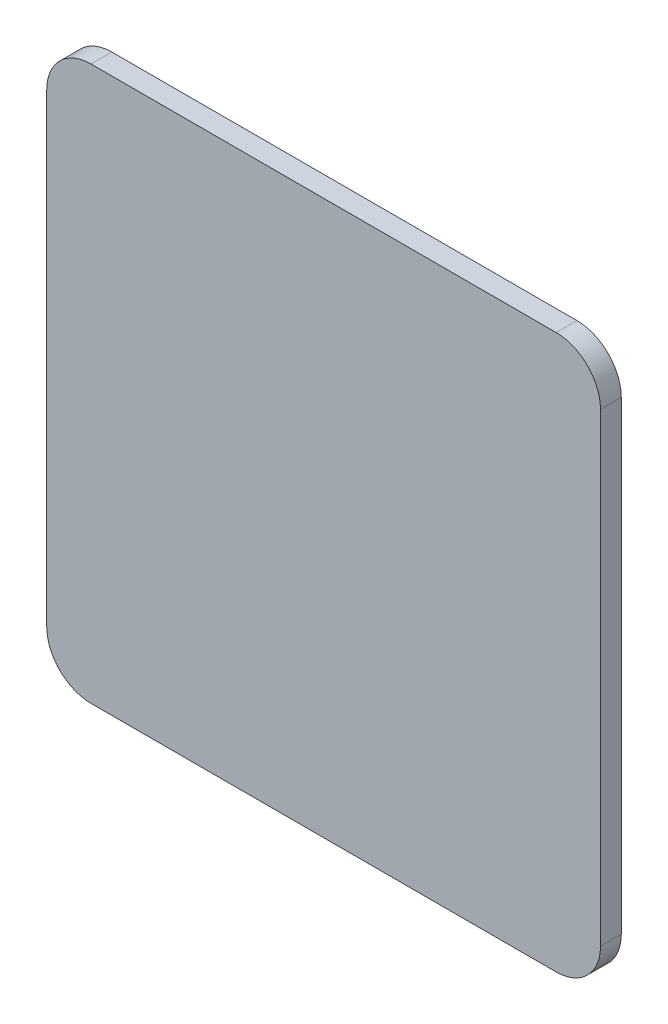
ISO-10303-21;
HEADER;
FILE_DESCRIPTION(('STEP AP214'),'2;1');
FILE_NAME('part.step','',(''),(''),'','','');
FILE_SCHEMA(('AUTOMOTIVE_DESIGN { 1 0 10303 214 1 1 1 1 }'));
ENDSEC;
DATA;
#1=APPLICATION_CONTEXT('core data for automotive mechanical design processes');
#2=APPLICATION_PROTOCOL_DEFINITION('international standard','automotive_design',2000,#1);
#3=PRODUCT_CONTEXT('',#1,'mechanical');
#4=PRODUCT('Part','Part','',(#3));
#5=PRODUCT_RELATED_PRODUCT_CATEGORY('part','',(#4));
#6=PRODUCT_DEFINITION_FORMATION('','',#4);
#7=PRODUCT_DEFINITION_CONTEXT('part definition',#1,'design');
#8=PRODUCT_DEFINITION('design','',#6,#7);
#9=PRODUCT_DEFINITION_SHAPE('','',#8);
#10=(LENGTH_UNIT() NAMED_UNIT(*) SI_UNIT(.MILLI.,.METRE.));
#11=(NAMED_UNIT(*) PLANE_ANGLE_UNIT() SI_UNIT($,.RADIAN.));
#12=(NAMED_UNIT(*) SI_UNIT($,.STERADIAN.) SOLID_ANGLE_UNIT());
#13=UNCERTAINTY_MEASURE_WITH_UNIT(LENGTH_MEASURE(1.E-05),#10,'distance_accuracy_value','');
#14=(GEOMETRIC_REPRESENTATION_CONTEXT(3) GLOBAL_UNCERTAINTY_ASSIGNED_CONTEXT((#13)) GLOBAL_UNIT_ASSIGNED_CONTEXT((#10,
#11,#12)) REPRESENTATION_CONTEXT('',''));
#15=CARTESIAN_POINT('',(0.,0.,0.));
#16=DIRECTION('',(0.,0.,1.));
#17=DIRECTION('',(1.,0.,0.));
#18=AXIS2_PLACEMENT_3D('',#15,#16,#17);
#19=CARTESIAN_POINT('',(0.,63.5,4.7625));
#20=DIRECTION('',(0.,-1.,0.));
#21=DIRECTION('',(1.,0.,0.));
#22=AXIS2_PLACEMENT_3D('',#19,#20,#21);
#23=PLANE('',#22);
#24=DIRECTION('',(-1.,0.,0.));
#25=VECTOR('',#24,1.);
#26=CARTESIAN_POINT('',(0.,63.5,0.));
#27=LINE('',#26,#25);
#28=CARTESIAN_POINT('',(53.3399999999999,63.5,0.));
#29=VERTEX_POINT('',#28);
#30=CARTESIAN_POINT('',(-53.3399999999999,63.5,0.));
#31=VERTEX_POINT('',#30);
#32=EDGE_CURVE('E131',#29,#31,#27,.T.);
#33=ORIENTED_EDGE('',*,*,#32,.T.);
#34=DIRECTION('',(0.,0.,-1.));
#35=VECTOR('',#34,1.);
#36=CARTESIAN_POINT('',(-53.3399999999999,63.5,4.7625));
#37=LINE('',#36,#35);
#38=CARTESIAN_POINT('',(-53.3399999999999,63.5,4.7625));
#39=VERTEX_POINT('',#38);
#40=EDGE_CURVE('E11',#39,#31,#37,.T.);
#41=ORIENTED_EDGE('',*,*,#40,.F.);
#42=DIRECTION('',(-1.,0.,0.));
#43=VECTOR('',#42,1.);
#44=CARTESIAN_POINT('',(0.,63.5,4.7625));
#45=LINE('',#44,#43);
#46=CARTESIAN_POINT('',(53.3399999999999,63.5,4.7625));
#47=VERTEX_POINT('',#46);
#48=EDGE_CURVE('E148',#47,#39,#45,.T.);
#49=ORIENTED_EDGE('',*,*,#48,.F.);
#50=DIRECTION('',(0.,0.,-1.));
#51=VECTOR('',#50,1.);
#52=CARTESIAN_POINT('',(53.3399999999999,63.5,4.7625));
#53=LINE('',#52,#51);
#54=EDGE_CURVE('E127',#47,#29,#53,.T.);
#55=ORIENTED_EDGE('',*,*,#54,.T.);
#56=EDGE_LOOP('',(#33,#41,#49,#55));
#57=FACE_BOUND('',#56,.T.);
#58=ADVANCED_FACE('F37',(#57),#23,.F.);
#59=CARTESIAN_POINT('',(-53.34,53.34,4.7625));
#60=DIRECTION('',(0.,0.,-1.));
#61=DIRECTION('',(-1.,0.,0.));
#62=AXIS2_PLACEMENT_3D('',#59,#60,#61);
#63=CYLINDRICAL_SURFACE('',#62,10.16);
#64=CARTESIAN_POINT('',(-53.34,53.34,0.));
#65=DIRECTION('',(0.,0.,1.));
#66=DIRECTION('',(1.,0.,0.));
#67=AXIS2_PLACEMENT_3D('',#64,#65,#66);
#68=CIRCLE('',#67,10.16);
#69=CARTESIAN_POINT('',(-63.5,53.3399999999999,0.));
#70=VERTEX_POINT('',#69);
#71=EDGE_CURVE('E134',#31,#70,#68,.T.);
#72=ORIENTED_EDGE('',*,*,#71,.T.);
#73=DIRECTION('',(0.,0.,-1.));
#74=VECTOR('',#73,1.);
#75=CARTESIAN_POINT('',(-63.5,53.3399999999999,4.7625));
#76=LINE('',#75,#74);
#77=CARTESIAN_POINT('',(-63.5,53.3399999999999,4.7625));
#78=VERTEX_POINT('',#77);
#79=EDGE_CURVE('E45',#78,#70,#76,.T.);
#80=ORIENTED_EDGE('',*,*,#79,.F.);
#81=CARTESIAN_POINT('',(-53.34,53.34,4.7625));
#82=DIRECTION('',(0.,0.,1.));
#83=DIRECTION('',(1.,0.,0.));
#84=AXIS2_PLACEMENT_3D('',#81,#82,#83);
#85=CIRCLE('',#84,10.16);
#86=EDGE_CURVE('E92',#39,#78,#85,.T.);
#87=ORIENTED_EDGE('',*,*,#86,.F.);
#88=ORIENTED_EDGE('',*,*,#40,.T.);
#89=EDGE_LOOP('',(#72,#80,#87,#88));
#90=FACE_BOUND('',#89,.T.);
#91=ADVANCED_FACE('F180',(#90),#63,.T.);
#92=CARTESIAN_POINT('',(-63.5,0.,4.7625));
#93=DIRECTION('',(1.,0.,0.));
#94=DIRECTION('',(0.,1.,0.));
#95=AXIS2_PLACEMENT_3D('',#92,#93,#94);
#96=PLANE('',#95);
#97=DIRECTION('',(0.,-1.,0.));
#98=VECTOR('',#97,1.);
#99=CARTESIAN_POINT('',(-63.5,0.,0.));
#100=LINE('',#99,#98);
#101=CARTESIAN_POINT('',(-63.5,-53.34,0.));
#102=VERTEX_POINT('',#101);
#103=EDGE_CURVE('E136',#70,#102,#100,.T.);
#104=ORIENTED_EDGE('',*,*,#103,.T.);
#105=DIRECTION('',(0.,0.,-1.));
#106=VECTOR('',#105,1.);
#107=CARTESIAN_POINT('',(-63.5,-53.34,4.7625));
#108=LINE('',#107,#106);
#109=CARTESIAN_POINT('',(-63.5,-53.34,4.7625));
#110=VERTEX_POINT('',#109);
#111=EDGE_CURVE('E154',#110,#102,#108,.T.);
#112=ORIENTED_EDGE('',*,*,#111,.F.);
#113=DIRECTION('',(0.,-1.,0.));
#114=VECTOR('',#113,1.);
#115=CARTESIAN_POINT('',(-63.5,0.,4.7625));
#116=LINE('',#115,#114);
#117=EDGE_CURVE('E162',#78,#110,#116,.T.);
#118=ORIENTED_EDGE('',*,*,#117,.F.);
#119=ORIENTED_EDGE('',*,*,#79,.T.);
#120=EDGE_LOOP('',(#104,#112,#118,#119));
#121=FACE_BOUND('',#120,.T.);
#122=ADVANCED_FACE('F160',(#121),#96,.F.);
#123=CARTESIAN_POINT('',(-53.34,-53.34,4.7625));
#124=DIRECTION('',(0.,0.,-1.));
#125=DIRECTION('',(-1.,0.,0.));
#126=AXIS2_PLACEMENT_3D('',#123,#124,#125);
#127=CYLINDRICAL_SURFACE('',#126,10.16);
#128=CARTESIAN_POINT('',(-53.34,-53.34,0.));
#129=DIRECTION('',(0.,0.,1.));
#130=DIRECTION('',(1.,0.,0.));
#131=AXIS2_PLACEMENT_3D('',#128,#129,#130);
#132=CIRCLE('',#131,10.16);
#133=CARTESIAN_POINT('',(-53.3399999999999,-63.5,0.));
#134=VERTEX_POINT('',#133);
#135=EDGE_CURVE('E138',#102,#134,#132,.T.);
#136=ORIENTED_EDGE('',*,*,#135,.T.);
#137=DIRECTION('',(0.,0.,-1.));
#138=VECTOR('',#137,1.);
#139=CARTESIAN_POINT('',(-53.3399999999999,-63.5,4.7625));
#140=LINE('',#139,#138);
#141=CARTESIAN_POINT('',(-53.3399999999999,-63.5,4.7625));
#142=VERTEX_POINT('',#141);
#143=EDGE_CURVE('E152',#142,#134,#140,.T.);
#144=ORIENTED_EDGE('',*,*,#143,.F.);
#145=CARTESIAN_POINT('',(-53.34,-53.34,4.7625));
#146=DIRECTION('',(0.,0.,1.));
#147=DIRECTION('',(1.,0.,0.));
#148=AXIS2_PLACEMENT_3D('',#145,#146,#147);
#149=CIRCLE('',#148,10.16);
#150=EDGE_CURVE('E172',#110,#142,#149,.T.);
#151=ORIENTED_EDGE('',*,*,#150,.F.);
#152=ORIENTED_EDGE('',*,*,#111,.T.);
#153=EDGE_LOOP('',(#136,#144,#151,#152));
#154=FACE_BOUND('',#153,.T.);
#155=ADVANCED_FACE('F170',(#154),#127,.T.);
#156=CARTESIAN_POINT('',(0.,-63.5,4.7625));
#157=DIRECTION('',(0.,-1.,0.));
#158=DIRECTION('',(1.,0.,0.));
#159=AXIS2_PLACEMENT_3D('',#156,#157,#158);
#160=PLANE('',#159);
#161=DIRECTION('',(-1.,0.,0.));
#162=VECTOR('',#161,1.);
#163=CARTESIAN_POINT('',(0.,-63.5,0.));
#164=LINE('',#163,#162);
#165=CARTESIAN_POINT('',(53.3399999999999,-63.5,0.));
#166=VERTEX_POINT('',#165);
#167=EDGE_CURVE('E141',#166,#134,#164,.T.);
#168=ORIENTED_EDGE('',*,*,#167,.F.);
#169=DIRECTION('',(0.,0.,-1.));
#170=VECTOR('',#169,1.);
#171=CARTESIAN_POINT('',(53.3399999999999,-63.5,4.7625));
#172=LINE('',#171,#170);
#173=CARTESIAN_POINT('',(53.3399999999999,-63.5,4.7625));
#174=VERTEX_POINT('',#173);
#175=EDGE_CURVE('E123',#174,#166,#172,.T.);
#176=ORIENTED_EDGE('',*,*,#175,.F.);
#177=DIRECTION('',(-1.,0.,0.));
#178=VECTOR('',#177,1.);
#179=CARTESIAN_POINT('',(0.,-63.5,4.7625));
#180=LINE('',#179,#178);
#181=EDGE_CURVE('E112',#174,#142,#180,.T.);
#182=ORIENTED_EDGE('',*,*,#181,.T.);
#183=ORIENTED_EDGE('',*,*,#143,.T.);
#184=EDGE_LOOP('',(#168,#176,#182,#183));
#185=FACE_BOUND('',#184,.T.);
#186=ADVANCED_FACE('F190',(#185),#160,.T.);
#187=CARTESIAN_POINT('',(53.34,-53.34,4.7625));
#188=DIRECTION('',(0.,0.,-1.));
#189=DIRECTION('',(-1.,0.,0.));
#190=AXIS2_PLACEMENT_3D('',#187,#188,#189);
#191=CYLINDRICAL_SURFACE('',#190,10.16);
#192=CARTESIAN_POINT('',(53.34,-53.34,0.));
#193=DIRECTION('',(0.,0.,1.));
#194=DIRECTION('',(1.,0.,0.));
#195=AXIS2_PLACEMENT_3D('',#192,#193,#194);
#196=CIRCLE('',#195,10.16);
#197=CARTESIAN_POINT('',(63.5,-53.3399999999999,0.));
#198=VERTEX_POINT('',#197);
#199=EDGE_CURVE('E119',#166,#198,#196,.T.);
#200=ORIENTED_EDGE('',*,*,#199,.T.);
#201=DIRECTION('',(0.,0.,-1.));
#202=VECTOR('',#201,1.);
#203=CARTESIAN_POINT('',(63.5,-53.3399999999999,4.7625));
#204=LINE('',#203,#202);
#205=CARTESIAN_POINT('',(63.5,-53.3399999999999,4.7625));
#206=VERTEX_POINT('',#205);
#207=EDGE_CURVE('E116',#206,#198,#204,.T.);
#208=ORIENTED_EDGE('',*,*,#207,.F.);
#209=CARTESIAN_POINT('',(53.34,-53.34,4.7625));
#210=DIRECTION('',(0.,0.,1.));
#211=DIRECTION('',(1.,0.,0.));
#212=AXIS2_PLACEMENT_3D('',#209,#210,#211);
#213=CIRCLE('',#212,10.16);
#214=EDGE_CURVE('E106',#174,#206,#213,.T.);
#215=ORIENTED_EDGE('',*,*,#214,.F.);
#216=ORIENTED_EDGE('',*,*,#175,.T.);
#217=EDGE_LOOP('',(#200,#208,#215,#216));
#218=FACE_BOUND('',#217,.T.);
#219=ADVANCED_FACE('F117',(#218),#191,.T.);
#220=CARTESIAN_POINT('',(63.5,0.,4.7625));
#221=DIRECTION('',(1.,0.,0.));
#222=DIRECTION('',(0.,1.,0.));
#223=AXIS2_PLACEMENT_3D('',#220,#221,#222);
#224=PLANE('',#223);
#225=DIRECTION('',(0.,-1.,0.));
#226=VECTOR('',#225,1.);
#227=CARTESIAN_POINT('',(63.5,0.,0.));
#228=LINE('',#227,#226);
#229=CARTESIAN_POINT('',(63.5,53.3399999999999,0.));
#230=VERTEX_POINT('',#229);
#231=EDGE_CURVE('E145',#230,#198,#228,.T.);
#232=ORIENTED_EDGE('',*,*,#231,.F.);
#233=DIRECTION('',(0.,0.,-1.));
#234=VECTOR('',#233,1.);
#235=CARTESIAN_POINT('',(63.5,53.3399999999999,4.7625));
#236=LINE('',#235,#234);
#237=CARTESIAN_POINT('',(63.5,53.3399999999999,4.7625));
#238=VERTEX_POINT('',#237);
#239=EDGE_CURVE('E81',#238,#230,#236,.T.);
#240=ORIENTED_EDGE('',*,*,#239,.F.);
#241=DIRECTION('',(0.,-1.,0.));
#242=VECTOR('',#241,1.);
#243=CARTESIAN_POINT('',(63.5,0.,4.7625));
#244=LINE('',#243,#242);
#245=EDGE_CURVE('E110',#238,#206,#244,.T.);
#246=ORIENTED_EDGE('',*,*,#245,.T.);
#247=ORIENTED_EDGE('',*,*,#207,.T.);
#248=EDGE_LOOP('',(#232,#240,#246,#247));
#249=FACE_BOUND('',#248,.T.);
#250=ADVANCED_FACE('F125',(#249),#224,.T.);
#251=CARTESIAN_POINT('',(53.34,53.34,4.7625));
#252=DIRECTION('',(0.,0.,-1.));
#253=DIRECTION('',(-1.,0.,0.));
#254=AXIS2_PLACEMENT_3D('',#251,#252,#253);
#255=CYLINDRICAL_SURFACE('',#254,10.16);
#256=CARTESIAN_POINT('',(53.34,53.34,0.));
#257=DIRECTION('',(0.,0.,1.));
#258=DIRECTION('',(1.,0.,0.));
#259=AXIS2_PLACEMENT_3D('',#256,#257,#258);
#260=CIRCLE('',#259,10.16);
#261=EDGE_CURVE('E84',#230,#29,#260,.T.);
#262=ORIENTED_EDGE('',*,*,#261,.T.);
#263=ORIENTED_EDGE('',*,*,#54,.F.);
#264=CARTESIAN_POINT('',(53.34,53.34,4.7625));
#265=DIRECTION('',(0.,0.,1.));
#266=DIRECTION('',(1.,0.,0.));
#267=AXIS2_PLACEMENT_3D('',#264,#265,#266);
#268=CIRCLE('',#267,10.16);
#269=EDGE_CURVE('E53',#238,#47,#268,.T.);
#270=ORIENTED_EDGE('',*,*,#269,.F.);
#271=ORIENTED_EDGE('',*,*,#239,.T.);
#272=EDGE_LOOP('',(#262,#263,#270,#271));
#273=FACE_BOUND('',#272,.T.);
#274=ADVANCED_FACE('F198',(#273),#255,.T.);
#275=CARTESIAN_POINT('',(0.,0.,4.7625));
#276=DIRECTION('',(0.,0.,1.));
#277=DIRECTION('',(1.,0.,0.));
#278=AXIS2_PLACEMENT_3D('',#275,#276,#277);
#279=PLANE('',#278);
#280=ORIENTED_EDGE('',*,*,#48,.T.);
#281=ORIENTED_EDGE('',*,*,#86,.T.);
#282=ORIENTED_EDGE('',*,*,#117,.T.);
#283=ORIENTED_EDGE('',*,*,#150,.T.);
#284=ORIENTED_EDGE('',*,*,#181,.F.);
#285=ORIENTED_EDGE('',*,*,#214,.T.);
#286=ORIENTED_EDGE('',*,*,#245,.F.);
#287=ORIENTED_EDGE('',*,*,#269,.T.);
#288=EDGE_LOOP('',(#280,#281,#282,#283,#284,#285,#286,#287));
#289=FACE_BOUND('',#288,.T.);
#290=ADVANCED_FACE('F108',(#289),#279,.T.);
#291=CARTESIAN_POINT('',(0.,0.,0.));
#292=DIRECTION('',(0.,0.,1.));
#293=DIRECTION('',(1.,0.,0.));
#294=AXIS2_PLACEMENT_3D('',#291,#292,#293);
#295=PLANE('',#294);
#296=ORIENTED_EDGE('',*,*,#32,.F.);
#297=ORIENTED_EDGE('',*,*,#261,.F.);
#298=ORIENTED_EDGE('',*,*,#231,.T.);
#299=ORIENTED_EDGE('',*,*,#199,.F.);
#300=ORIENTED_EDGE('',*,*,#167,.T.);
#301=ORIENTED_EDGE('',*,*,#135,.F.);
#302=ORIENTED_EDGE('',*,*,#103,.F.);
#303=ORIENTED_EDGE('',*,*,#71,.F.);
#304=EDGE_LOOP('',(#296,#297,#298,#299,#300,#301,#302,#303));
#305=FACE_BOUND('',#304,.T.);
#306=ADVANCED_FACE('F166',(#305),#295,.F.);
#307=CLOSED_SHELL('',(#58,#91,#122,#155,#186,#219,#250,#274,#290,#306));
#308=MANIFOLD_SOLID_BREP('B2',#307);
#309=ADVANCED_BREP_SHAPE_REPRESENTATION('',(#18,#308),#14);
#310=SHAPE_DEFINITION_REPRESENTATION(#9,#309);
ENDSEC;
END-ISO-10303-21;
